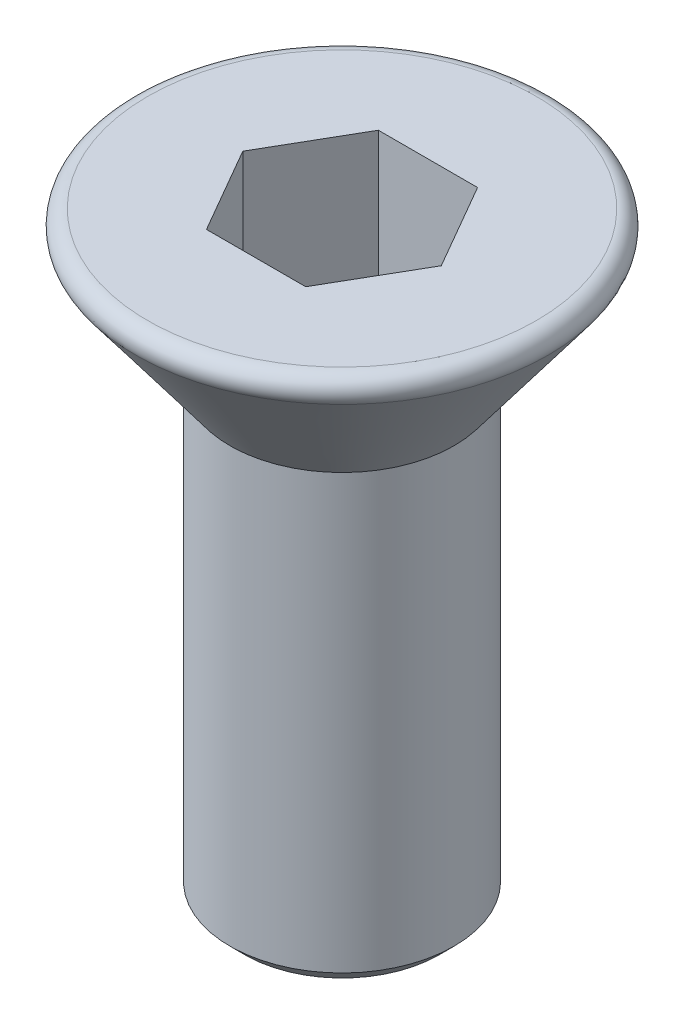
ISO-10303-21;
HEADER;
FILE_DESCRIPTION(('STEP AP214'),'2;1');
FILE_NAME('part.step','',(''),(''),'','','');
FILE_SCHEMA(('AUTOMOTIVE_DESIGN { 1 0 10303 214 1 1 1 1 }'));
ENDSEC;
DATA;
#1=APPLICATION_CONTEXT('core data for automotive mechanical design processes');
#2=APPLICATION_PROTOCOL_DEFINITION('international standard','automotive_design',2000,#1);
#3=PRODUCT_CONTEXT('',#1,'mechanical');
#4=PRODUCT('Part','Part','',(#3));
#5=PRODUCT_RELATED_PRODUCT_CATEGORY('part','',(#4));
#6=PRODUCT_DEFINITION_FORMATION('','',#4);
#7=PRODUCT_DEFINITION_CONTEXT('part definition',#1,'design');
#8=PRODUCT_DEFINITION('design','',#6,#7);
#9=PRODUCT_DEFINITION_SHAPE('','',#8);
#10=(LENGTH_UNIT() NAMED_UNIT(*) SI_UNIT(.MILLI.,.METRE.));
#11=(NAMED_UNIT(*) PLANE_ANGLE_UNIT() SI_UNIT($,.RADIAN.));
#12=(NAMED_UNIT(*) SI_UNIT($,.STERADIAN.) SOLID_ANGLE_UNIT());
#13=UNCERTAINTY_MEASURE_WITH_UNIT(LENGTH_MEASURE(1.E-05),#10,'distance_accuracy_value','');
#14=(GEOMETRIC_REPRESENTATION_CONTEXT(3) GLOBAL_UNCERTAINTY_ASSIGNED_CONTEXT((#13)) GLOBAL_UNIT_ASSIGNED_CONTEXT((#10,
#11,#12)) REPRESENTATION_CONTEXT('',''));
#15=CARTESIAN_POINT('',(0.,0.,0.));
#16=DIRECTION('',(0.,0.,1.));
#17=DIRECTION('',(1.,0.,0.));
#18=AXIS2_PLACEMENT_3D('',#15,#16,#17);
#19=CARTESIAN_POINT('',(3.,0.,0.));
#20=DIRECTION('',(0.,-1.,0.));
#21=DIRECTION('',(1.,0.,0.));
#22=AXIS2_PLACEMENT_3D('',#19,#20,#21);
#23=PLANE('',#22);
#24=CARTESIAN_POINT('',(0.,0.,0.));
#25=DIRECTION('',(0.,-1.,0.));
#26=DIRECTION('',(1.,0.,0.));
#27=AXIS2_PLACEMENT_3D('',#24,#25,#26);
#28=CIRCLE('',#27,2.6);
#29=CARTESIAN_POINT('',(2.6,0.,0.));
#30=VERTEX_POINT('',#29);
#31=EDGE_CURVE('E42',#30,#30,#28,.F.);
#32=ORIENTED_EDGE('',*,*,#31,.T.);
#33=EDGE_LOOP('',(#32));
#34=FACE_BOUND('',#33,.T.);
#35=DIRECTION('',(0.5,0.,0.866025403784439));
#36=VECTOR('',#35,1.);
#37=CARTESIAN_POINT('',(-1.32790561913614,0.,0.));
#38=LINE('',#37,#36);
#39=CARTESIAN_POINT('',(-1.32790561913614,0.,0.));
#40=VERTEX_POINT('',#39);
#41=CARTESIAN_POINT('',(-0.66395280956807,0.,1.15));
#42=VERTEX_POINT('',#41);
#43=EDGE_CURVE('E123',#40,#42,#38,.T.);
#44=ORIENTED_EDGE('',*,*,#43,.F.);
#45=DIRECTION('',(-0.5,0.,0.866025403784438));
#46=VECTOR('',#45,1.);
#47=CARTESIAN_POINT('',(-0.66395280956807,0.,-1.15));
#48=LINE('',#47,#46);
#49=CARTESIAN_POINT('',(-0.66395280956807,0.,-1.15));
#50=VERTEX_POINT('',#49);
#51=EDGE_CURVE('E49',#50,#40,#48,.T.);
#52=ORIENTED_EDGE('',*,*,#51,.F.);
#53=DIRECTION('',(-1.,0.,0.));
#54=VECTOR('',#53,1.);
#55=CARTESIAN_POINT('',(0.66395280956807,0.,-1.15));
#56=LINE('',#55,#54);
#57=CARTESIAN_POINT('',(0.66395280956807,0.,-1.15));
#58=VERTEX_POINT('',#57);
#59=EDGE_CURVE('E132',#58,#50,#56,.T.);
#60=ORIENTED_EDGE('',*,*,#59,.F.);
#61=DIRECTION('',(-0.5,0.,-0.866025403784439));
#62=VECTOR('',#61,1.);
#63=CARTESIAN_POINT('',(1.32790561913614,0.,0.));
#64=LINE('',#63,#62);
#65=CARTESIAN_POINT('',(1.32790561913614,0.,0.));
#66=VERTEX_POINT('',#65);
#67=EDGE_CURVE('E130',#66,#58,#64,.T.);
#68=ORIENTED_EDGE('',*,*,#67,.F.);
#69=DIRECTION('',(0.5,0.,-0.866025403784439));
#70=VECTOR('',#69,1.);
#71=CARTESIAN_POINT('',(0.66395280956807,0.,1.15));
#72=LINE('',#71,#70);
#73=CARTESIAN_POINT('',(0.66395280956807,0.,1.15));
#74=VERTEX_POINT('',#73);
#75=EDGE_CURVE('E97',#74,#66,#72,.T.);
#76=ORIENTED_EDGE('',*,*,#75,.F.);
#77=DIRECTION('',(1.,0.,0.));
#78=VECTOR('',#77,1.);
#79=CARTESIAN_POINT('',(-0.66395280956807,0.,1.15));
#80=LINE('',#79,#78);
#81=EDGE_CURVE('E126',#42,#74,#80,.T.);
#82=ORIENTED_EDGE('',*,*,#81,.F.);
#83=EDGE_LOOP('',(#44,#52,#60,#68,#76,#82));
#84=FACE_BOUND('',#83,.T.);
#85=ADVANCED_FACE('F34',(#34,#84),#23,.F.);
#86=CARTESIAN_POINT('',(0.,-2.,0.));
#87=DIRECTION('',(0.,1.,0.));
#88=DIRECTION('',(-1.,0.,0.));
#89=AXIS2_PLACEMENT_3D('',#86,#87,#88);
#90=CONICAL_SURFACE('',#89,1.5,0.643501108793284);
#91=CARTESIAN_POINT('',(0.,-0.32,0.));
#92=DIRECTION('',(0.,-1.,0.));
#93=DIRECTION('',(1.,0.,0.));
#94=AXIS2_PLACEMENT_3D('',#91,#92,#93);
#95=CIRCLE('',#94,2.76);
#96=CARTESIAN_POINT('',(2.76,-0.32,0.));
#97=VERTEX_POINT('',#96);
#98=EDGE_CURVE('E11',#97,#97,#95,.T.);
#99=ORIENTED_EDGE('',*,*,#98,.T.);
#100=EDGE_LOOP('',(#99));
#101=FACE_BOUND('',#100,.T.);
#102=CARTESIAN_POINT('',(0.,-2.,0.));
#103=DIRECTION('',(0.,-1.,0.));
#104=DIRECTION('',(1.,0.,0.));
#105=AXIS2_PLACEMENT_3D('',#102,#103,#104);
#106=CIRCLE('',#105,1.5);
#107=CARTESIAN_POINT('',(1.5,-2.,0.));
#108=VERTEX_POINT('',#107);
#109=EDGE_CURVE('E136',#108,#108,#106,.T.);
#110=ORIENTED_EDGE('',*,*,#109,.F.);
#111=EDGE_LOOP('',(#110));
#112=FACE_BOUND('',#111,.T.);
#113=ADVANCED_FACE('F163',(#101,#112),#90,.T.);
#114=CARTESIAN_POINT('',(0.,-8.,0.));
#115=DIRECTION('',(0.,1.,0.));
#116=DIRECTION('',(-1.,0.,0.));
#117=AXIS2_PLACEMENT_3D('',#114,#115,#116);
#118=CYLINDRICAL_SURFACE('',#117,1.5);
#119=CARTESIAN_POINT('',(0.,-7.8,0.));
#120=DIRECTION('',(0.,-1.,0.));
#121=DIRECTION('',(1.,0.,0.));
#122=AXIS2_PLACEMENT_3D('',#119,#120,#121);
#123=CIRCLE('',#122,1.5);
#124=CARTESIAN_POINT('',(1.5,-7.8,0.));
#125=VERTEX_POINT('',#124);
#126=EDGE_CURVE('E147',#125,#125,#123,.F.);
#127=ORIENTED_EDGE('',*,*,#126,.T.);
#128=EDGE_LOOP('',(#127));
#129=FACE_BOUND('',#128,.T.);
#130=ORIENTED_EDGE('',*,*,#109,.T.);
#131=EDGE_LOOP('',(#130));
#132=FACE_BOUND('',#131,.T.);
#133=ADVANCED_FACE('F168',(#129,#132),#118,.T.);
#134=CARTESIAN_POINT('',(0.,-8.,0.));
#135=DIRECTION('',(0.,-1.,0.));
#136=DIRECTION('',(1.,0.,0.));
#137=AXIS2_PLACEMENT_3D('',#134,#135,#136);
#138=PLANE('',#137);
#139=CARTESIAN_POINT('',(0.,-8.,0.));
#140=DIRECTION('',(0.,-1.,0.));
#141=DIRECTION('',(1.,0.,0.));
#142=AXIS2_PLACEMENT_3D('',#139,#140,#141);
#143=CIRCLE('',#142,1.3);
#144=CARTESIAN_POINT('',(1.3,-8.,0.));
#145=VERTEX_POINT('',#144);
#146=EDGE_CURVE('E144',#145,#145,#143,.T.);
#147=ORIENTED_EDGE('',*,*,#146,.T.);
#148=EDGE_LOOP('',(#147));
#149=FACE_BOUND('',#148,.T.);
#150=ADVANCED_FACE('F174',(#149),#138,.T.);
#151=CARTESIAN_POINT('',(-0.663952809568069,-2.,-1.15));
#152=DIRECTION('',(-0.866025403784439,0.,-0.5));
#153=DIRECTION('',(-0.5,0.,0.866025403784438));
#154=AXIS2_PLACEMENT_3D('',#151,#152,#153);
#155=PLANE('',#154);
#156=ORIENTED_EDGE('',*,*,#51,.T.);
#157=DIRECTION('',(0.,1.,0.));
#158=VECTOR('',#157,1.);
#159=CARTESIAN_POINT('',(-1.32790561913614,-2.,0.));
#160=LINE('',#159,#158);
#161=CARTESIAN_POINT('',(-1.32790561913614,-2.,0.));
#162=VERTEX_POINT('',#161);
#163=EDGE_CURVE('E79',#162,#40,#160,.T.);
#164=ORIENTED_EDGE('',*,*,#163,.F.);
#165=DIRECTION('',(-0.5,0.,0.866025403784438));
#166=VECTOR('',#165,1.);
#167=CARTESIAN_POINT('',(-0.663952809568069,-2.,-1.15));
#168=LINE('',#167,#166);
#169=CARTESIAN_POINT('',(-0.663952809568069,-2.,-1.15));
#170=VERTEX_POINT('',#169);
#171=EDGE_CURVE('E134',#170,#162,#168,.T.);
#172=ORIENTED_EDGE('',*,*,#171,.F.);
#173=DIRECTION('',(0.,1.,0.));
#174=VECTOR('',#173,1.);
#175=CARTESIAN_POINT('',(-0.663952809568069,-2.,-1.15));
#176=LINE('',#175,#174);
#177=EDGE_CURVE('E57',#170,#50,#176,.T.);
#178=ORIENTED_EDGE('',*,*,#177,.T.);
#179=EDGE_LOOP('',(#156,#164,#172,#178));
#180=FACE_BOUND('',#179,.T.);
#181=ADVANCED_FACE('F178',(#180),#155,.F.);
#182=CARTESIAN_POINT('',(0.66395280956807,-2.,-1.15));
#183=DIRECTION('',(0.,0.,-1.));
#184=DIRECTION('',(-1.,0.,0.));
#185=AXIS2_PLACEMENT_3D('',#182,#183,#184);
#186=PLANE('',#185);
#187=ORIENTED_EDGE('',*,*,#59,.T.);
#188=ORIENTED_EDGE('',*,*,#177,.F.);
#189=DIRECTION('',(-1.,0.,0.));
#190=VECTOR('',#189,1.);
#191=CARTESIAN_POINT('',(0.66395280956807,-2.,-1.15));
#192=LINE('',#191,#190);
#193=CARTESIAN_POINT('',(0.66395280956807,-2.,-1.15));
#194=VERTEX_POINT('',#193);
#195=EDGE_CURVE('E109',#194,#170,#192,.T.);
#196=ORIENTED_EDGE('',*,*,#195,.F.);
#197=DIRECTION('',(0.,1.,0.));
#198=VECTOR('',#197,1.);
#199=CARTESIAN_POINT('',(0.66395280956807,-2.,-1.15));
#200=LINE('',#199,#198);
#201=EDGE_CURVE('E101',#194,#58,#200,.T.);
#202=ORIENTED_EDGE('',*,*,#201,.T.);
#203=EDGE_LOOP('',(#187,#188,#196,#202));
#204=FACE_BOUND('',#203,.T.);
#205=ADVANCED_FACE('F182',(#204),#186,.F.);
#206=CARTESIAN_POINT('',(1.32790561913614,-2.,0.));
#207=DIRECTION('',(0.866025403784439,0.,-0.5));
#208=DIRECTION('',(-0.5,0.,-0.866025403784439));
#209=AXIS2_PLACEMENT_3D('',#206,#207,#208);
#210=PLANE('',#209);
#211=ORIENTED_EDGE('',*,*,#67,.T.);
#212=ORIENTED_EDGE('',*,*,#201,.F.);
#213=DIRECTION('',(-0.5,0.,-0.866025403784439));
#214=VECTOR('',#213,1.);
#215=CARTESIAN_POINT('',(1.32790561913614,-2.,0.));
#216=LINE('',#215,#214);
#217=CARTESIAN_POINT('',(1.32790561913614,-2.,0.));
#218=VERTEX_POINT('',#217);
#219=EDGE_CURVE('E105',#218,#194,#216,.T.);
#220=ORIENTED_EDGE('',*,*,#219,.F.);
#221=DIRECTION('',(0.,1.,0.));
#222=VECTOR('',#221,1.);
#223=CARTESIAN_POINT('',(1.32790561913614,-2.,0.));
#224=LINE('',#223,#222);
#225=EDGE_CURVE('E90',#218,#66,#224,.T.);
#226=ORIENTED_EDGE('',*,*,#225,.T.);
#227=EDGE_LOOP('',(#211,#212,#220,#226));
#228=FACE_BOUND('',#227,.T.);
#229=ADVANCED_FACE('F106',(#228),#210,.F.);
#230=CARTESIAN_POINT('',(0.66395280956807,-2.,1.15));
#231=DIRECTION('',(0.866025403784439,0.,0.5));
#232=DIRECTION('',(0.5,0.,-0.866025403784439));
#233=AXIS2_PLACEMENT_3D('',#230,#231,#232);
#234=PLANE('',#233);
#235=ORIENTED_EDGE('',*,*,#75,.T.);
#236=ORIENTED_EDGE('',*,*,#225,.F.);
#237=DIRECTION('',(0.5,0.,-0.866025403784439));
#238=VECTOR('',#237,1.);
#239=CARTESIAN_POINT('',(0.66395280956807,-2.,1.15));
#240=LINE('',#239,#238);
#241=CARTESIAN_POINT('',(0.66395280956807,-2.,1.15));
#242=VERTEX_POINT('',#241);
#243=EDGE_CURVE('E94',#242,#218,#240,.T.);
#244=ORIENTED_EDGE('',*,*,#243,.F.);
#245=DIRECTION('',(0.,1.,0.));
#246=VECTOR('',#245,1.);
#247=CARTESIAN_POINT('',(0.66395280956807,-2.,1.15));
#248=LINE('',#247,#246);
#249=EDGE_CURVE('E102',#242,#74,#248,.T.);
#250=ORIENTED_EDGE('',*,*,#249,.T.);
#251=EDGE_LOOP('',(#235,#236,#244,#250));
#252=FACE_BOUND('',#251,.T.);
#253=ADVANCED_FACE('F92',(#252),#234,.F.);
#254=CARTESIAN_POINT('',(-0.66395280956807,-2.,1.15));
#255=DIRECTION('',(0.,0.,1.));
#256=DIRECTION('',(1.,0.,0.));
#257=AXIS2_PLACEMENT_3D('',#254,#255,#256);
#258=PLANE('',#257);
#259=ORIENTED_EDGE('',*,*,#81,.T.);
#260=ORIENTED_EDGE('',*,*,#249,.F.);
#261=DIRECTION('',(1.,0.,0.));
#262=VECTOR('',#261,1.);
#263=CARTESIAN_POINT('',(-0.66395280956807,-2.,1.15));
#264=LINE('',#263,#262);
#265=CARTESIAN_POINT('',(-0.66395280956807,-2.,1.15));
#266=VERTEX_POINT('',#265);
#267=EDGE_CURVE('E115',#266,#242,#264,.T.);
#268=ORIENTED_EDGE('',*,*,#267,.F.);
#269=DIRECTION('',(0.,1.,0.));
#270=VECTOR('',#269,1.);
#271=CARTESIAN_POINT('',(-0.66395280956807,-2.,1.15));
#272=LINE('',#271,#270);
#273=EDGE_CURVE('E139',#266,#42,#272,.T.);
#274=ORIENTED_EDGE('',*,*,#273,.T.);
#275=EDGE_LOOP('',(#259,#260,#268,#274));
#276=FACE_BOUND('',#275,.T.);
#277=ADVANCED_FACE('F186',(#276),#258,.F.);
#278=CARTESIAN_POINT('',(-1.32790561913614,-2.,0.));
#279=DIRECTION('',(-0.866025403784439,0.,0.5));
#280=DIRECTION('',(0.5,0.,0.866025403784439));
#281=AXIS2_PLACEMENT_3D('',#278,#279,#280);
#282=PLANE('',#281);
#283=ORIENTED_EDGE('',*,*,#43,.T.);
#284=ORIENTED_EDGE('',*,*,#273,.F.);
#285=DIRECTION('',(0.5,0.,0.866025403784439));
#286=VECTOR('',#285,1.);
#287=CARTESIAN_POINT('',(-1.32790561913614,-2.,0.));
#288=LINE('',#287,#286);
#289=EDGE_CURVE('E117',#162,#266,#288,.T.);
#290=ORIENTED_EDGE('',*,*,#289,.F.);
#291=ORIENTED_EDGE('',*,*,#163,.T.);
#292=EDGE_LOOP('',(#283,#284,#290,#291));
#293=FACE_BOUND('',#292,.T.);
#294=ADVANCED_FACE('F183',(#293),#282,.F.);
#295=CARTESIAN_POINT('',(0.,-2.,0.));
#296=DIRECTION('',(0.,1.,0.));
#297=DIRECTION('',(-1.,0.,0.));
#298=AXIS2_PLACEMENT_3D('',#295,#296,#297);
#299=PLANE('',#298);
#300=ORIENTED_EDGE('',*,*,#171,.T.);
#301=ORIENTED_EDGE('',*,*,#289,.T.);
#302=ORIENTED_EDGE('',*,*,#267,.T.);
#303=ORIENTED_EDGE('',*,*,#243,.T.);
#304=ORIENTED_EDGE('',*,*,#219,.T.);
#305=ORIENTED_EDGE('',*,*,#195,.T.);
#306=EDGE_LOOP('',(#300,#301,#302,#303,#304,#305));
#307=FACE_BOUND('',#306,.T.);
#308=ADVANCED_FACE('F112',(#307),#299,.T.);
#309=CARTESIAN_POINT('',(0.,-8.,0.));
#310=DIRECTION('',(0.,1.,0.));
#311=DIRECTION('',(-1.,0.,0.));
#312=AXIS2_PLACEMENT_3D('',#309,#310,#311);
#313=CONICAL_SURFACE('',#312,1.3,0.785398163397445);
#314=ORIENTED_EDGE('',*,*,#126,.F.);
#315=EDGE_LOOP('',(#314));
#316=FACE_BOUND('',#315,.T.);
#317=ORIENTED_EDGE('',*,*,#146,.F.);
#318=EDGE_LOOP('',(#317));
#319=FACE_BOUND('',#318,.T.);
#320=ADVANCED_FACE('F155',(#316,#319),#313,.T.);
#321=CARTESIAN_POINT('',(0.,-0.2,0.));
#322=DIRECTION('',(0.,-1.,0.));
#323=DIRECTION('',(1.,0.,0.));
#324=AXIS2_PLACEMENT_3D('',#321,#322,#323);
#325=TOROIDAL_SURFACE('',#324,2.6,0.2);
#326=ORIENTED_EDGE('',*,*,#98,.F.);
#327=EDGE_LOOP('',(#326));
#328=FACE_BOUND('',#327,.T.);
#329=ORIENTED_EDGE('',*,*,#31,.F.);
#330=EDGE_LOOP('',(#329));
#331=FACE_BOUND('',#330,.T.);
#332=ADVANCED_FACE('F36',(#328,#331),#325,.T.);
#333=CLOSED_SHELL('',(#85,#113,#133,#150,#181,#205,#229,#253,#277,#294,#308,#320,#332));
#334=MANIFOLD_SOLID_BREP('B2',#333);
#335=ADVANCED_BREP_SHAPE_REPRESENTATION('',(#18,#334),#14);
#336=SHAPE_DEFINITION_REPRESENTATION(#9,#335);
ENDSEC;
END-ISO-10303-21;
